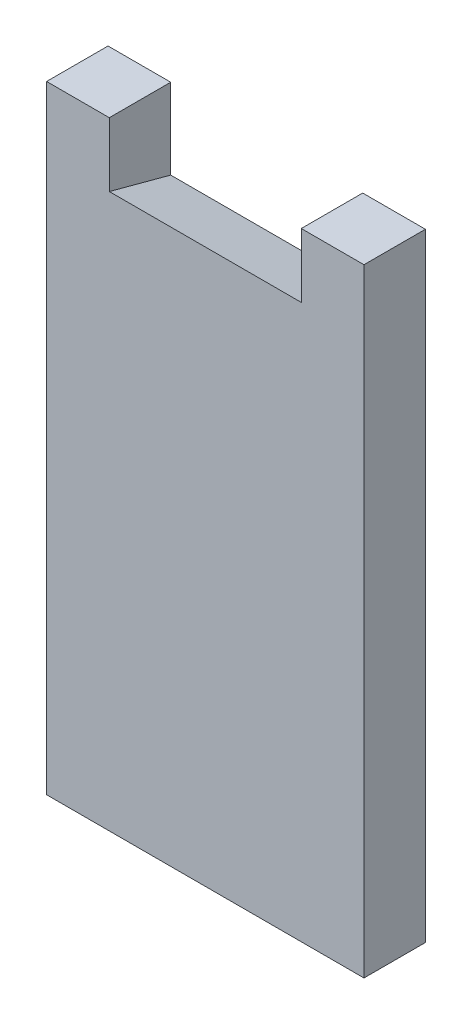
ISO-10303-21;
HEADER;
FILE_DESCRIPTION(('STEP AP214'),'2;1');
FILE_NAME('part.step','',(''),(''),'','','');
FILE_SCHEMA(('AUTOMOTIVE_DESIGN { 1 0 10303 214 1 1 1 1 }'));
ENDSEC;
DATA;
#1=APPLICATION_CONTEXT('core data for automotive mechanical design processes');
#2=APPLICATION_PROTOCOL_DEFINITION('international standard','automotive_design',2000,#1);
#3=PRODUCT_CONTEXT('',#1,'mechanical');
#4=PRODUCT('Part','Part','',(#3));
#5=PRODUCT_RELATED_PRODUCT_CATEGORY('part','',(#4));
#6=PRODUCT_DEFINITION_FORMATION('','',#4);
#7=PRODUCT_DEFINITION_CONTEXT('part definition',#1,'design');
#8=PRODUCT_DEFINITION('design','',#6,#7);
#9=PRODUCT_DEFINITION_SHAPE('','',#8);
#10=(LENGTH_UNIT() NAMED_UNIT(*) SI_UNIT(.MILLI.,.METRE.));
#11=(NAMED_UNIT(*) PLANE_ANGLE_UNIT() SI_UNIT($,.RADIAN.));
#12=(NAMED_UNIT(*) SI_UNIT($,.STERADIAN.) SOLID_ANGLE_UNIT());
#13=UNCERTAINTY_MEASURE_WITH_UNIT(LENGTH_MEASURE(1.E-05),#10,'distance_accuracy_value','');
#14=(GEOMETRIC_REPRESENTATION_CONTEXT(3) GLOBAL_UNCERTAINTY_ASSIGNED_CONTEXT((#13)) GLOBAL_UNIT_ASSIGNED_CONTEXT((#10,
#11,#12)) REPRESENTATION_CONTEXT('',''));
#15=CARTESIAN_POINT('',(0.,0.,0.));
#16=DIRECTION('',(0.,0.,1.));
#17=DIRECTION('',(1.,0.,0.));
#18=AXIS2_PLACEMENT_3D('',#15,#16,#17);
#19=CARTESIAN_POINT('',(0.,0.,9.6));
#20=DIRECTION('',(0.,1.,0.));
#21=DIRECTION('',(0.,0.,1.));
#22=AXIS2_PLACEMENT_3D('',#19,#20,#21);
#23=PLANE('',#22);
#24=DIRECTION('',(1.,0.,0.));
#25=VECTOR('',#24,1.);
#26=CARTESIAN_POINT('',(0.,0.,0.));
#27=LINE('',#26,#25);
#28=CARTESIAN_POINT('',(39.8,0.,0.));
#29=VERTEX_POINT('',#28);
#30=CARTESIAN_POINT('',(49.6,0.,0.));
#31=VERTEX_POINT('',#30);
#32=EDGE_CURVE('E116',#29,#31,#27,.T.);
#33=ORIENTED_EDGE('',*,*,#32,.F.);
#34=DIRECTION('',(0.,0.,-1.));
#35=VECTOR('',#34,1.);
#36=CARTESIAN_POINT('',(39.8,0.,9.6));
#37=LINE('',#36,#35);
#38=CARTESIAN_POINT('',(39.8,0.,9.6));
#39=VERTEX_POINT('',#38);
#40=EDGE_CURVE('E11',#39,#29,#37,.T.);
#41=ORIENTED_EDGE('',*,*,#40,.F.);
#42=DIRECTION('',(1.,0.,0.));
#43=VECTOR('',#42,1.);
#44=CARTESIAN_POINT('',(0.,0.,9.6));
#45=LINE('',#44,#43);
#46=CARTESIAN_POINT('',(49.6,0.,9.6));
#47=VERTEX_POINT('',#46);
#48=EDGE_CURVE('E126',#39,#47,#45,.T.);
#49=ORIENTED_EDGE('',*,*,#48,.T.);
#50=DIRECTION('',(0.,0.,-1.));
#51=VECTOR('',#50,1.);
#52=CARTESIAN_POINT('',(49.6,0.,9.6));
#53=LINE('',#52,#51);
#54=EDGE_CURVE('E57',#47,#31,#53,.T.);
#55=ORIENTED_EDGE('',*,*,#54,.T.);
#56=EDGE_LOOP('',(#33,#41,#49,#55));
#57=FACE_BOUND('',#56,.T.);
#58=ADVANCED_FACE('F38',(#57),#23,.T.);
#59=CARTESIAN_POINT('',(39.8,0.,9.6));
#60=DIRECTION('',(1.,0.,0.));
#61=DIRECTION('',(0.,0.,-1.));
#62=AXIS2_PLACEMENT_3D('',#59,#60,#61);
#63=PLANE('',#62);
#64=DIRECTION('',(0.,-1.,0.));
#65=VECTOR('',#64,1.);
#66=CARTESIAN_POINT('',(39.8,0.,0.));
#67=LINE('',#66,#65);
#68=CARTESIAN_POINT('',(39.8,-12.5723122473388,0.));
#69=VERTEX_POINT('',#68);
#70=EDGE_CURVE('E106',#29,#69,#67,.T.);
#71=ORIENTED_EDGE('',*,*,#70,.T.);
#72=DIRECTION('',(0.,-0.258819045102521,-0.965925826289068));
#73=VECTOR('',#72,1.);
#74=CARTESIAN_POINT('',(39.8,-9.99999999999999,9.6));
#75=LINE('',#74,#73);
#76=CARTESIAN_POINT('',(39.8,-9.99999999999999,9.6));
#77=VERTEX_POINT('',#76);
#78=EDGE_CURVE('E48',#77,#69,#75,.T.);
#79=ORIENTED_EDGE('',*,*,#78,.F.);
#80=DIRECTION('',(0.,-1.,0.));
#81=VECTOR('',#80,1.);
#82=CARTESIAN_POINT('',(39.8,0.,9.6));
#83=LINE('',#82,#81);
#84=EDGE_CURVE('E154',#39,#77,#83,.T.);
#85=ORIENTED_EDGE('',*,*,#84,.F.);
#86=ORIENTED_EDGE('',*,*,#40,.T.);
#87=EDGE_LOOP('',(#71,#79,#85,#86));
#88=FACE_BOUND('',#87,.T.);
#89=ADVANCED_FACE('F163',(#88),#63,.F.);
#90=CARTESIAN_POINT('',(0.,-10.,9.6));
#91=DIRECTION('',(0.,0.965925826289068,-0.258819045102521));
#92=DIRECTION('',(0.,0.258819045102521,0.965925826289068));
#93=AXIS2_PLACEMENT_3D('',#90,#91,#92);
#94=PLANE('',#93);
#95=DIRECTION('',(1.,0.,0.));
#96=VECTOR('',#95,1.);
#97=CARTESIAN_POINT('',(0.,-12.5723122473388,0.));
#98=LINE('',#97,#96);
#99=CARTESIAN_POINT('',(9.79999999999999,-12.5723122473388,0.));
#100=VERTEX_POINT('',#99);
#101=EDGE_CURVE('E103',#100,#69,#98,.T.);
#102=ORIENTED_EDGE('',*,*,#101,.F.);
#103=DIRECTION('',(0.,-0.258819045102521,-0.965925826289068));
#104=VECTOR('',#103,1.);
#105=CARTESIAN_POINT('',(9.79999999999999,-10.,9.6));
#106=LINE('',#105,#104);
#107=CARTESIAN_POINT('',(9.79999999999999,-10.,9.6));
#108=VERTEX_POINT('',#107);
#109=EDGE_CURVE('E42',#108,#100,#106,.T.);
#110=ORIENTED_EDGE('',*,*,#109,.F.);
#111=DIRECTION('',(1.,0.,0.));
#112=VECTOR('',#111,1.);
#113=CARTESIAN_POINT('',(0.,-10.,9.6));
#114=LINE('',#113,#112);
#115=EDGE_CURVE('E150',#108,#77,#114,.T.);
#116=ORIENTED_EDGE('',*,*,#115,.T.);
#117=ORIENTED_EDGE('',*,*,#78,.T.);
#118=EDGE_LOOP('',(#102,#110,#116,#117));
#119=FACE_BOUND('',#118,.T.);
#120=ADVANCED_FACE('F40',(#119),#94,.T.);
#121=CARTESIAN_POINT('',(9.8,0.,9.6));
#122=DIRECTION('',(1.,0.,0.));
#123=DIRECTION('',(0.,1.,0.));
#124=AXIS2_PLACEMENT_3D('',#121,#122,#123);
#125=PLANE('',#124);
#126=DIRECTION('',(0.,-1.,0.));
#127=VECTOR('',#126,1.);
#128=CARTESIAN_POINT('',(9.8,0.,0.));
#129=LINE('',#128,#127);
#130=CARTESIAN_POINT('',(9.8,0.,0.));
#131=VERTEX_POINT('',#130);
#132=EDGE_CURVE('E95',#131,#100,#129,.T.);
#133=ORIENTED_EDGE('',*,*,#132,.F.);
#134=DIRECTION('',(0.,0.,-1.));
#135=VECTOR('',#134,1.);
#136=CARTESIAN_POINT('',(9.8,0.,9.6));
#137=LINE('',#136,#135);
#138=CARTESIAN_POINT('',(9.8,0.,9.6));
#139=VERTEX_POINT('',#138);
#140=EDGE_CURVE('E101',#139,#131,#137,.T.);
#141=ORIENTED_EDGE('',*,*,#140,.F.);
#142=DIRECTION('',(0.,-1.,0.));
#143=VECTOR('',#142,1.);
#144=CARTESIAN_POINT('',(9.8,0.,9.6));
#145=LINE('',#144,#143);
#146=EDGE_CURVE('E99',#139,#108,#145,.T.);
#147=ORIENTED_EDGE('',*,*,#146,.T.);
#148=ORIENTED_EDGE('',*,*,#109,.T.);
#149=EDGE_LOOP('',(#133,#141,#147,#148));
#150=FACE_BOUND('',#149,.T.);
#151=ADVANCED_FACE('F92',(#150),#125,.T.);
#152=CARTESIAN_POINT('',(0.,0.,0.));
#153=VERTEX_POINT('',#152);
#154=EDGE_CURVE('E112',#153,#131,#27,.T.);
#155=ORIENTED_EDGE('',*,*,#154,.F.);
#156=DIRECTION('',(0.,0.,-1.));
#157=VECTOR('',#156,1.);
#158=CARTESIAN_POINT('',(0.,0.,9.6));
#159=LINE('',#158,#157);
#160=CARTESIAN_POINT('',(0.,0.,9.6));
#161=VERTEX_POINT('',#160);
#162=EDGE_CURVE('E134',#161,#153,#159,.T.);
#163=ORIENTED_EDGE('',*,*,#162,.F.);
#164=EDGE_CURVE('E142',#161,#139,#45,.T.);
#165=ORIENTED_EDGE('',*,*,#164,.T.);
#166=ORIENTED_EDGE('',*,*,#140,.T.);
#167=EDGE_LOOP('',(#155,#163,#165,#166));
#168=FACE_BOUND('',#167,.T.);
#169=ADVANCED_FACE('F138',(#168),#23,.T.);
#170=CARTESIAN_POINT('',(0.,0.,9.6));
#171=DIRECTION('',(1.,0.,0.));
#172=DIRECTION('',(0.,1.,0.));
#173=AXIS2_PLACEMENT_3D('',#170,#171,#172);
#174=PLANE('',#173);
#175=DIRECTION('',(0.,-1.,0.));
#176=VECTOR('',#175,1.);
#177=CARTESIAN_POINT('',(0.,0.,0.));
#178=LINE('',#177,#176);
#179=CARTESIAN_POINT('',(0.,-96.54,0.));
#180=VERTEX_POINT('',#179);
#181=EDGE_CURVE('E114',#153,#180,#178,.T.);
#182=ORIENTED_EDGE('',*,*,#181,.T.);
#183=DIRECTION('',(0.,0.,-1.));
#184=VECTOR('',#183,1.);
#185=CARTESIAN_POINT('',(0.,-96.54,9.6));
#186=LINE('',#185,#184);
#187=CARTESIAN_POINT('',(0.,-96.54,9.6));
#188=VERTEX_POINT('',#187);
#189=EDGE_CURVE('E131',#188,#180,#186,.T.);
#190=ORIENTED_EDGE('',*,*,#189,.F.);
#191=DIRECTION('',(0.,-1.,0.));
#192=VECTOR('',#191,1.);
#193=CARTESIAN_POINT('',(0.,0.,9.6));
#194=LINE('',#193,#192);
#195=EDGE_CURVE('E152',#161,#188,#194,.T.);
#196=ORIENTED_EDGE('',*,*,#195,.F.);
#197=ORIENTED_EDGE('',*,*,#162,.T.);
#198=EDGE_LOOP('',(#182,#190,#196,#197));
#199=FACE_BOUND('',#198,.T.);
#200=ADVANCED_FACE('F177',(#199),#174,.F.);
#201=CARTESIAN_POINT('',(0.,-96.54,9.6));
#202=DIRECTION('',(0.,1.,0.));
#203=DIRECTION('',(0.,0.,1.));
#204=AXIS2_PLACEMENT_3D('',#201,#202,#203);
#205=PLANE('',#204);
#206=DIRECTION('',(1.,0.,0.));
#207=VECTOR('',#206,1.);
#208=CARTESIAN_POINT('',(0.,-96.54,0.));
#209=LINE('',#208,#207);
#210=CARTESIAN_POINT('',(49.6,-96.54,0.));
#211=VERTEX_POINT('',#210);
#212=EDGE_CURVE('E120',#180,#211,#209,.T.);
#213=ORIENTED_EDGE('',*,*,#212,.T.);
#214=DIRECTION('',(0.,0.,-1.));
#215=VECTOR('',#214,1.);
#216=CARTESIAN_POINT('',(49.6,-96.54,9.6));
#217=LINE('',#216,#215);
#218=CARTESIAN_POINT('',(49.6,-96.54,9.6));
#219=VERTEX_POINT('',#218);
#220=EDGE_CURVE('E128',#219,#211,#217,.T.);
#221=ORIENTED_EDGE('',*,*,#220,.F.);
#222=DIRECTION('',(1.,0.,0.));
#223=VECTOR('',#222,1.);
#224=CARTESIAN_POINT('',(0.,-96.54,9.6));
#225=LINE('',#224,#223);
#226=EDGE_CURVE('E159',#188,#219,#225,.T.);
#227=ORIENTED_EDGE('',*,*,#226,.F.);
#228=ORIENTED_EDGE('',*,*,#189,.T.);
#229=EDGE_LOOP('',(#213,#221,#227,#228));
#230=FACE_BOUND('',#229,.T.);
#231=ADVANCED_FACE('F174',(#230),#205,.F.);
#232=CARTESIAN_POINT('',(49.6,0.,9.6));
#233=DIRECTION('',(1.,0.,0.));
#234=DIRECTION('',(0.,1.,0.));
#235=AXIS2_PLACEMENT_3D('',#232,#233,#234);
#236=PLANE('',#235);
#237=DIRECTION('',(0.,-1.,0.));
#238=VECTOR('',#237,1.);
#239=CARTESIAN_POINT('',(49.6,0.,0.));
#240=LINE('',#239,#238);
#241=EDGE_CURVE('E123',#31,#211,#240,.T.);
#242=ORIENTED_EDGE('',*,*,#241,.F.);
#243=ORIENTED_EDGE('',*,*,#54,.F.);
#244=DIRECTION('',(0.,-1.,0.));
#245=VECTOR('',#244,1.);
#246=CARTESIAN_POINT('',(49.6,0.,9.6));
#247=LINE('',#246,#245);
#248=EDGE_CURVE('E129',#47,#219,#247,.T.);
#249=ORIENTED_EDGE('',*,*,#248,.T.);
#250=ORIENTED_EDGE('',*,*,#220,.T.);
#251=EDGE_LOOP('',(#242,#243,#249,#250));
#252=FACE_BOUND('',#251,.T.);
#253=ADVANCED_FACE('F171',(#252),#236,.T.);
#254=CARTESIAN_POINT('',(0.,0.,9.6));
#255=DIRECTION('',(0.,0.,1.));
#256=DIRECTION('',(1.,0.,0.));
#257=AXIS2_PLACEMENT_3D('',#254,#255,#256);
#258=PLANE('',#257);
#259=ORIENTED_EDGE('',*,*,#48,.F.);
#260=ORIENTED_EDGE('',*,*,#84,.T.);
#261=ORIENTED_EDGE('',*,*,#115,.F.);
#262=ORIENTED_EDGE('',*,*,#146,.F.);
#263=ORIENTED_EDGE('',*,*,#164,.F.);
#264=ORIENTED_EDGE('',*,*,#195,.T.);
#265=ORIENTED_EDGE('',*,*,#226,.T.);
#266=ORIENTED_EDGE('',*,*,#248,.F.);
#267=EDGE_LOOP('',(#259,#260,#261,#262,#263,#264,#265,#266));
#268=FACE_BOUND('',#267,.T.);
#269=ADVANCED_FACE('F147',(#268),#258,.T.);
#270=CARTESIAN_POINT('',(0.,0.,0.));
#271=DIRECTION('',(0.,0.,1.));
#272=DIRECTION('',(1.,0.,0.));
#273=AXIS2_PLACEMENT_3D('',#270,#271,#272);
#274=PLANE('',#273);
#275=ORIENTED_EDGE('',*,*,#32,.T.);
#276=ORIENTED_EDGE('',*,*,#241,.T.);
#277=ORIENTED_EDGE('',*,*,#212,.F.);
#278=ORIENTED_EDGE('',*,*,#181,.F.);
#279=ORIENTED_EDGE('',*,*,#154,.T.);
#280=ORIENTED_EDGE('',*,*,#132,.T.);
#281=ORIENTED_EDGE('',*,*,#101,.T.);
#282=ORIENTED_EDGE('',*,*,#70,.F.);
#283=EDGE_LOOP('',(#275,#276,#277,#278,#279,#280,#281,#282));
#284=FACE_BOUND('',#283,.T.);
#285=ADVANCED_FACE('F109',(#284),#274,.F.);
#286=CLOSED_SHELL('',(#58,#89,#120,#151,#169,#200,#231,#253,#269,#285));
#287=MANIFOLD_SOLID_BREP('B2',#286);
#288=ADVANCED_BREP_SHAPE_REPRESENTATION('',(#18,#287),#14);
#289=SHAPE_DEFINITION_REPRESENTATION(#9,#288);
ENDSEC;
END-ISO-10303-21;
